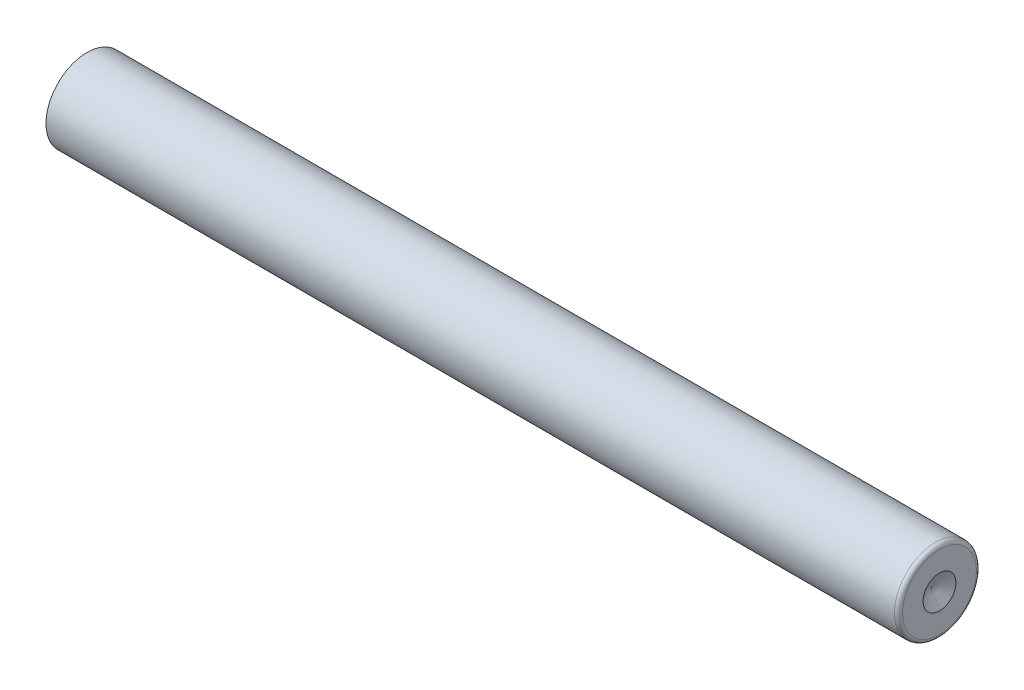
ISO-10303-21;
HEADER;
FILE_DESCRIPTION(('STEP AP214'),'2;1');
FILE_NAME('part.step','',(''),(''),'','','');
FILE_SCHEMA(('AUTOMOTIVE_DESIGN { 1 0 10303 214 1 1 1 1 }'));
ENDSEC;
DATA;
#1=APPLICATION_CONTEXT('core data for automotive mechanical design processes');
#2=APPLICATION_PROTOCOL_DEFINITION('international standard','automotive_design',2000,#1);
#3=PRODUCT_CONTEXT('',#1,'mechanical');
#4=PRODUCT('Part','Part','',(#3));
#5=PRODUCT_RELATED_PRODUCT_CATEGORY('part','',(#4));
#6=PRODUCT_DEFINITION_FORMATION('','',#4);
#7=PRODUCT_DEFINITION_CONTEXT('part definition',#1,'design');
#8=PRODUCT_DEFINITION('design','',#6,#7);
#9=PRODUCT_DEFINITION_SHAPE('','',#8);
#10=(LENGTH_UNIT() NAMED_UNIT(*) SI_UNIT(.MILLI.,.METRE.));
#11=(NAMED_UNIT(*) PLANE_ANGLE_UNIT() SI_UNIT($,.RADIAN.));
#12=(NAMED_UNIT(*) SI_UNIT($,.STERADIAN.) SOLID_ANGLE_UNIT());
#13=UNCERTAINTY_MEASURE_WITH_UNIT(LENGTH_MEASURE(1.E-05),#10,'distance_accuracy_value','');
#14=(GEOMETRIC_REPRESENTATION_CONTEXT(3) GLOBAL_UNCERTAINTY_ASSIGNED_CONTEXT((#13)) GLOBAL_UNIT_ASSIGNED_CONTEXT((#10,
#11,#12)) REPRESENTATION_CONTEXT('',''));
#15=CARTESIAN_POINT('',(0.,0.,0.));
#16=DIRECTION('',(0.,0.,1.));
#17=DIRECTION('',(1.,0.,0.));
#18=AXIS2_PLACEMENT_3D('',#15,#16,#17);
#19=CARTESIAN_POINT('',(0.,0.,0.));
#20=DIRECTION('',(1.,0.,0.));
#21=DIRECTION('',(0.,0.,-1.));
#22=AXIS2_PLACEMENT_3D('',#19,#20,#21);
#23=PLANE('',#22);
#24=CARTESIAN_POINT('',(0.,0.,0.));
#25=DIRECTION('',(-1.,0.,0.));
#26=DIRECTION('',(0.,0.,1.));
#27=AXIS2_PLACEMENT_3D('',#24,#25,#26);
#28=CIRCLE('',#27,2.5);
#29=CARTESIAN_POINT('',(0.,0.,2.5));
#30=VERTEX_POINT('',#29);
#31=EDGE_CURVE('E52',#30,#30,#28,.T.);
#32=ORIENTED_EDGE('',*,*,#31,.T.);
#33=EDGE_LOOP('',(#32));
#34=FACE_BOUND('',#33,.T.);
#35=ADVANCED_FACE('F34',(#34),#23,.F.);
#36=CARTESIAN_POINT('',(0.,0.,0.));
#37=DIRECTION('',(-1.,0.,0.));
#38=DIRECTION('',(0.,0.,1.));
#39=AXIS2_PLACEMENT_3D('',#36,#37,#38);
#40=CYLINDRICAL_SURFACE('',#39,2.5);
#41=CARTESIAN_POINT('',(51.75,0.,0.));
#42=DIRECTION('',(-1.,0.,0.));
#43=DIRECTION('',(0.,0.,1.));
#44=AXIS2_PLACEMENT_3D('',#41,#42,#43);
#45=CIRCLE('',#44,2.5);
#46=CARTESIAN_POINT('',(51.75,0.,2.5));
#47=VERTEX_POINT('',#46);
#48=EDGE_CURVE('E41',#47,#47,#45,.T.);
#49=ORIENTED_EDGE('',*,*,#48,.T.);
#50=EDGE_LOOP('',(#49));
#51=FACE_BOUND('',#50,.T.);
#52=ORIENTED_EDGE('',*,*,#31,.F.);
#53=EDGE_LOOP('',(#52));
#54=FACE_BOUND('',#53,.T.);
#55=ADVANCED_FACE('F59',(#51,#54),#40,.T.);
#56=CARTESIAN_POINT('',(52.,0.,0.));
#57=DIRECTION('',(-1.,0.,0.));
#58=DIRECTION('',(0.,0.,1.));
#59=AXIS2_PLACEMENT_3D('',#56,#57,#58);
#60=PLANE('',#59);
#61=CARTESIAN_POINT('',(52.,0.,0.));
#62=DIRECTION('',(1.,0.,0.));
#63=DIRECTION('',(0.,1.,0.));
#64=AXIS2_PLACEMENT_3D('',#61,#62,#63);
#65=CIRCLE('',#64,1.);
#66=CARTESIAN_POINT('',(52.,1.,0.));
#67=VERTEX_POINT('',#66);
#68=EDGE_CURVE('E50',#67,#67,#65,.T.);
#69=ORIENTED_EDGE('',*,*,#68,.F.);
#70=EDGE_LOOP('',(#69));
#71=FACE_BOUND('',#70,.T.);
#72=CARTESIAN_POINT('',(52.,0.,0.));
#73=DIRECTION('',(-1.,0.,0.));
#74=DIRECTION('',(0.,0.,1.));
#75=AXIS2_PLACEMENT_3D('',#72,#73,#74);
#76=CIRCLE('',#75,2.25);
#77=CARTESIAN_POINT('',(52.,0.,2.25));
#78=VERTEX_POINT('',#77);
#79=EDGE_CURVE('E11',#78,#78,#76,.F.);
#80=ORIENTED_EDGE('',*,*,#79,.T.);
#81=EDGE_LOOP('',(#80));
#82=FACE_BOUND('',#81,.T.);
#83=ADVANCED_FACE('F63',(#71,#82),#60,.F.);
#84=CARTESIAN_POINT('',(51.75,0.,0.));
#85=DIRECTION('',(-1.,0.,0.));
#86=DIRECTION('',(0.,0.,1.));
#87=AXIS2_PLACEMENT_3D('',#84,#85,#86);
#88=TOROIDAL_SURFACE('',#87,2.25,0.25);
#89=ORIENTED_EDGE('',*,*,#79,.F.);
#90=EDGE_LOOP('',(#89));
#91=FACE_BOUND('',#90,.T.);
#92=ORIENTED_EDGE('',*,*,#48,.F.);
#93=EDGE_LOOP('',(#92));
#94=FACE_BOUND('',#93,.T.);
#95=ADVANCED_FACE('F36',(#91,#94),#88,.T.);
#96=CARTESIAN_POINT('',(52.,0.,0.));
#97=DIRECTION('',(1.,0.,0.));
#98=DIRECTION('',(0.,1.,0.));
#99=AXIS2_PLACEMENT_3D('',#96,#97,#98);
#100=CONICAL_SURFACE('',#99,1.,1.1071487177941);
#101=CARTESIAN_POINT('',(51.5,0.,0.));
#102=VERTEX_POINT('',#101);
#103=VERTEX_LOOP('',#102);
#104=FACE_BOUND('',#103,.T.);
#105=ORIENTED_EDGE('',*,*,#68,.T.);
#106=EDGE_LOOP('',(#105));
#107=FACE_BOUND('',#106,.T.);
#108=ADVANCED_FACE('F44',(#104,#107),#100,.F.);
#109=CLOSED_SHELL('',(#35,#55,#83,#95,#108));
#110=MANIFOLD_SOLID_BREP('B2',#109);
#111=ADVANCED_BREP_SHAPE_REPRESENTATION('',(#18,#110),#14);
#112=SHAPE_DEFINITION_REPRESENTATION(#9,#111);
ENDSEC;
END-ISO-10303-21;
